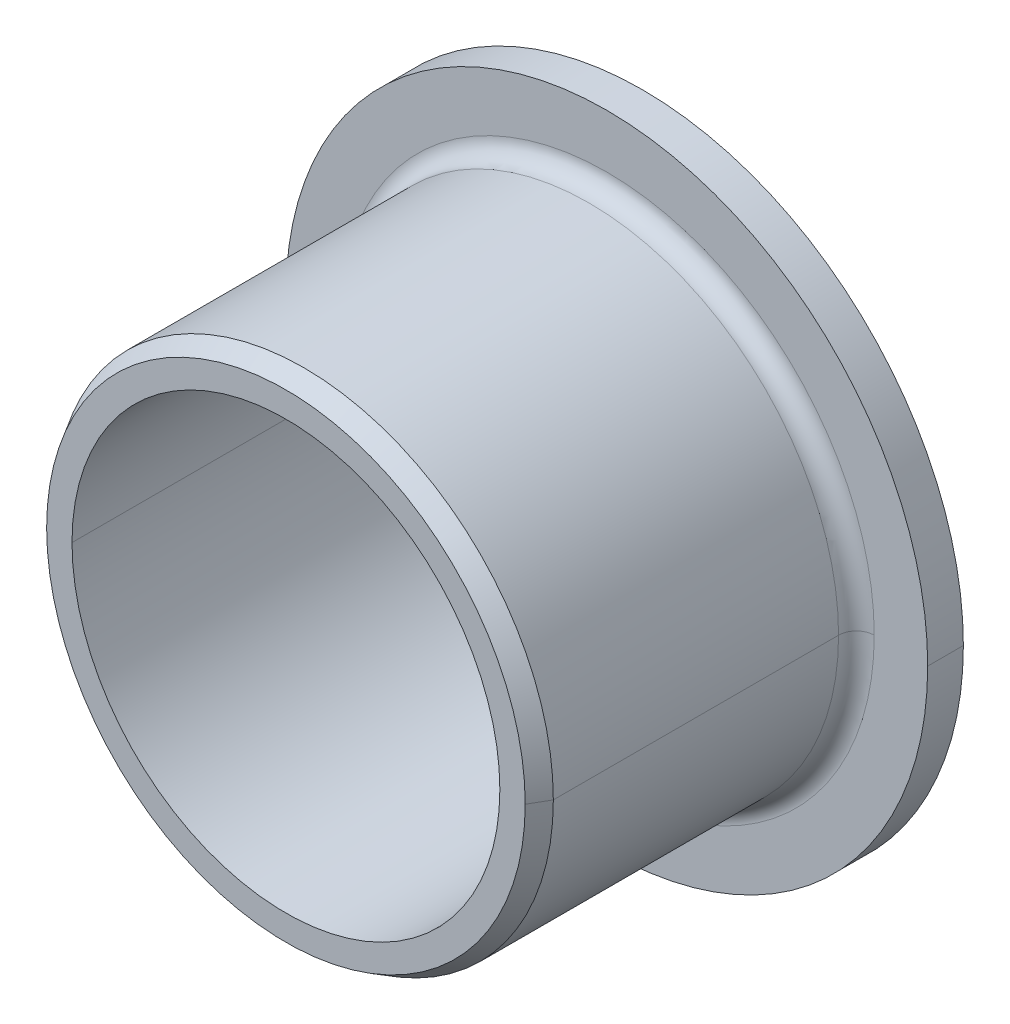
ISO-10303-21;
HEADER;
FILE_DESCRIPTION(('STEP AP214'),'2;1');
FILE_NAME('part.step','',(''),(''),'','','');
FILE_SCHEMA(('AUTOMOTIVE_DESIGN { 1 0 10303 214 1 1 1 1 }'));
ENDSEC;
DATA;
#1=APPLICATION_CONTEXT('core data for automotive mechanical design processes');
#2=APPLICATION_PROTOCOL_DEFINITION('international standard','automotive_design',2000,#1);
#3=PRODUCT_CONTEXT('',#1,'mechanical');
#4=PRODUCT('Part','Part','',(#3));
#5=PRODUCT_RELATED_PRODUCT_CATEGORY('part','',(#4));
#6=PRODUCT_DEFINITION_FORMATION('','',#4);
#7=PRODUCT_DEFINITION_CONTEXT('part definition',#1,'design');
#8=PRODUCT_DEFINITION('design','',#6,#7);
#9=PRODUCT_DEFINITION_SHAPE('','',#8);
#10=(LENGTH_UNIT() NAMED_UNIT(*) SI_UNIT(.MILLI.,.METRE.));
#11=(NAMED_UNIT(*) PLANE_ANGLE_UNIT() SI_UNIT($,.RADIAN.));
#12=(NAMED_UNIT(*) SI_UNIT($,.STERADIAN.) SOLID_ANGLE_UNIT());
#13=UNCERTAINTY_MEASURE_WITH_UNIT(LENGTH_MEASURE(1.E-05),#10,'distance_accuracy_value','');
#14=(GEOMETRIC_REPRESENTATION_CONTEXT(3) GLOBAL_UNCERTAINTY_ASSIGNED_CONTEXT((#13)) GLOBAL_UNIT_ASSIGNED_CONTEXT((#10,
#11,#12)) REPRESENTATION_CONTEXT('',''));
#15=CARTESIAN_POINT('',(0.,0.,0.));
#16=DIRECTION('',(0.,0.,1.));
#17=DIRECTION('',(1.,0.,0.));
#18=AXIS2_PLACEMENT_3D('',#15,#16,#17);
#19=CARTESIAN_POINT('',(7.5,0.,0.));
#20=DIRECTION('',(0.,0.,-1.));
#21=DIRECTION('',(0.,-1.,0.));
#22=AXIS2_PLACEMENT_3D('',#19,#20,#21);
#23=PLANE('',#22);
#24=CARTESIAN_POINT('',(0.,0.,0.));
#25=DIRECTION('',(0.,0.,1.));
#26=DIRECTION('',(1.,0.,0.));
#27=AXIS2_PLACEMENT_3D('',#24,#25,#26);
#28=CIRCLE('',#27,6.);
#29=CARTESIAN_POINT('',(6.,0.,0.));
#30=VERTEX_POINT('',#29);
#31=CARTESIAN_POINT('',(-6.,0.,0.));
#32=VERTEX_POINT('',#31);
#33=EDGE_CURVE('E10',#30,#32,#28,.T.);
#34=ORIENTED_EDGE('',*,*,#33,.T.);
#35=CARTESIAN_POINT('',(0.,0.,0.));
#36=DIRECTION('',(0.,0.,1.));
#37=DIRECTION('',(1.,0.,0.));
#38=AXIS2_PLACEMENT_3D('',#35,#36,#37);
#39=CIRCLE('',#38,6.);
#40=EDGE_CURVE('E325',#32,#30,#39,.T.);
#41=ORIENTED_EDGE('',*,*,#40,.T.);
#42=EDGE_LOOP('',(#34,#41));
#43=FACE_BOUND('',#42,.T.);
#44=CARTESIAN_POINT('',(0.,0.,0.));
#45=DIRECTION('',(0.,0.,1.));
#46=DIRECTION('',(1.,0.,0.));
#47=AXIS2_PLACEMENT_3D('',#44,#45,#46);
#48=CIRCLE('',#47,9.);
#49=CARTESIAN_POINT('',(9.,0.,0.));
#50=VERTEX_POINT('',#49);
#51=CARTESIAN_POINT('',(-9.,0.,0.));
#52=VERTEX_POINT('',#51);
#53=EDGE_CURVE('E398',#50,#52,#48,.T.);
#54=ORIENTED_EDGE('',*,*,#53,.F.);
#55=CARTESIAN_POINT('',(0.,0.,0.));
#56=DIRECTION('',(0.,0.,1.));
#57=DIRECTION('',(1.,0.,0.));
#58=AXIS2_PLACEMENT_3D('',#55,#56,#57);
#59=CIRCLE('',#58,9.);
#60=EDGE_CURVE('E100',#52,#50,#59,.T.);
#61=ORIENTED_EDGE('',*,*,#60,.F.);
#62=EDGE_LOOP('',(#54,#61));
#63=FACE_BOUND('',#62,.T.);
#64=ADVANCED_FACE('F15',(#43,#63),#23,.T.);
#65=CARTESIAN_POINT('',(0.,0.,5.));
#66=DIRECTION('',(0.,0.,1.));
#67=DIRECTION('',(1.,0.,0.));
#68=AXIS2_PLACEMENT_3D('',#65,#66,#67);
#69=CYLINDRICAL_SURFACE('',#68,6.);
#70=DIRECTION('',(0.,0.,1.));
#71=VECTOR('',#70,1.);
#72=CARTESIAN_POINT('',(6.,0.,5.));
#73=LINE('',#72,#71);
#74=CARTESIAN_POINT('',(6.,0.,10.));
#75=VERTEX_POINT('',#74);
#76=EDGE_CURVE('E329',#30,#75,#73,.T.);
#77=ORIENTED_EDGE('',*,*,#76,.T.);
#78=CARTESIAN_POINT('',(0.,0.,10.));
#79=DIRECTION('',(0.,0.,1.));
#80=DIRECTION('',(1.,0.,0.));
#81=AXIS2_PLACEMENT_3D('',#78,#79,#80);
#82=CIRCLE('',#81,6.);
#83=CARTESIAN_POINT('',(-6.,0.,10.));
#84=VERTEX_POINT('',#83);
#85=EDGE_CURVE('E26',#75,#84,#82,.T.);
#86=ORIENTED_EDGE('',*,*,#85,.T.);
#87=DIRECTION('',(0.,0.,-1.));
#88=VECTOR('',#87,1.);
#89=CARTESIAN_POINT('',(-6.,0.,5.));
#90=LINE('',#89,#88);
#91=EDGE_CURVE('E322',#84,#32,#90,.T.);
#92=ORIENTED_EDGE('',*,*,#91,.T.);
#93=ORIENTED_EDGE('',*,*,#33,.F.);
#94=EDGE_LOOP('',(#77,#86,#92,#93));
#95=FACE_BOUND('',#94,.T.);
#96=ADVANCED_FACE('F195',(#95),#69,.F.);
#97=CARTESIAN_POINT('',(6.3556624327,0.,10.));
#98=DIRECTION('',(0.,0.,1.));
#99=DIRECTION('',(1.,0.,0.));
#100=AXIS2_PLACEMENT_3D('',#97,#98,#99);
#101=PLANE('',#100);
#102=ORIENTED_EDGE('',*,*,#85,.F.);
#103=CARTESIAN_POINT('',(0.,0.,10.));
#104=DIRECTION('',(0.,0.,1.));
#105=DIRECTION('',(1.,0.,0.));
#106=AXIS2_PLACEMENT_3D('',#103,#104,#105);
#107=CIRCLE('',#106,6.);
#108=EDGE_CURVE('E315',#84,#75,#107,.T.);
#109=ORIENTED_EDGE('',*,*,#108,.F.);
#110=EDGE_LOOP('',(#102,#109));
#111=FACE_BOUND('',#110,.T.);
#112=CARTESIAN_POINT('',(0.,0.,10.));
#113=DIRECTION('',(0.,0.,1.));
#114=DIRECTION('',(1.,0.,0.));
#115=AXIS2_PLACEMENT_3D('',#112,#113,#114);
#116=CIRCLE('',#115,6.7113248654);
#117=CARTESIAN_POINT('',(6.7113248654,0.,10.));
#118=VERTEX_POINT('',#117);
#119=CARTESIAN_POINT('',(-6.7113248654,0.,10.));
#120=VERTEX_POINT('',#119);
#121=EDGE_CURVE('E19',#118,#120,#116,.T.);
#122=ORIENTED_EDGE('',*,*,#121,.T.);
#123=CARTESIAN_POINT('',(0.,0.,10.));
#124=DIRECTION('',(0.,0.,1.));
#125=DIRECTION('',(1.,0.,0.));
#126=AXIS2_PLACEMENT_3D('',#123,#124,#125);
#127=CIRCLE('',#126,6.7113248654);
#128=EDGE_CURVE('E82',#120,#118,#127,.T.);
#129=ORIENTED_EDGE('',*,*,#128,.T.);
#130=EDGE_LOOP('',(#122,#129));
#131=FACE_BOUND('',#130,.T.);
#132=ADVANCED_FACE('F200',(#111,#131),#101,.T.);
#133=CARTESIAN_POINT('',(0.,0.,9.75));
#134=DIRECTION('',(0.,0.,-1.));
#135=DIRECTION('',(1.,0.,0.));
#136=AXIS2_PLACEMENT_3D('',#133,#134,#135);
#137=CONICAL_SURFACE('',#136,6.8556624327,0.52359877560608);
#138=DIRECTION('',(-0.500000000006738,0.,0.866025403780548));
#139=VECTOR('',#138,1.);
#140=CARTESIAN_POINT('',(6.8556624327,0.,9.75));
#141=LINE('',#140,#139);
#142=CARTESIAN_POINT('',(7.,0.,9.5));
#143=VERTEX_POINT('',#142);
#144=EDGE_CURVE('E310',#143,#118,#141,.T.);
#145=ORIENTED_EDGE('',*,*,#144,.T.);
#146=ORIENTED_EDGE('',*,*,#128,.F.);
#147=DIRECTION('',(-0.500000000006738,0.,-0.866025403780548));
#148=VECTOR('',#147,1.);
#149=CARTESIAN_POINT('',(-6.8556624327,0.,9.75));
#150=LINE('',#149,#148);
#151=CARTESIAN_POINT('',(-7.,0.,9.5));
#152=VERTEX_POINT('',#151);
#153=EDGE_CURVE('E157',#120,#152,#150,.T.);
#154=ORIENTED_EDGE('',*,*,#153,.T.);
#155=CARTESIAN_POINT('',(0.,0.,9.5));
#156=DIRECTION('',(0.,0.,1.));
#157=DIRECTION('',(1.,0.,0.));
#158=AXIS2_PLACEMENT_3D('',#155,#156,#157);
#159=CIRCLE('',#158,7.);
#160=EDGE_CURVE('E72',#152,#143,#159,.T.);
#161=ORIENTED_EDGE('',*,*,#160,.T.);
#162=EDGE_LOOP('',(#145,#146,#154,#161));
#163=FACE_BOUND('',#162,.T.);
#164=ADVANCED_FACE('F17',(#163),#137,.T.);
#165=CARTESIAN_POINT('',(0.,0.,5.5));
#166=DIRECTION('',(0.,0.,1.));
#167=DIRECTION('',(1.,0.,0.));
#168=AXIS2_PLACEMENT_3D('',#165,#166,#167);
#169=CYLINDRICAL_SURFACE('',#168,7.);
#170=DIRECTION('',(0.,0.,1.));
#171=VECTOR('',#170,1.);
#172=CARTESIAN_POINT('',(7.,0.,5.5));
#173=LINE('',#172,#171);
#174=CARTESIAN_POINT('',(7.,0.,1.5));
#175=VERTEX_POINT('',#174);
#176=EDGE_CURVE('E156',#175,#143,#173,.T.);
#177=ORIENTED_EDGE('',*,*,#176,.T.);
#178=ORIENTED_EDGE('',*,*,#160,.F.);
#179=DIRECTION('',(0.,0.,-1.));
#180=VECTOR('',#179,1.);
#181=CARTESIAN_POINT('',(-7.,0.,5.5));
#182=LINE('',#181,#180);
#183=CARTESIAN_POINT('',(-7.,0.,1.5));
#184=VERTEX_POINT('',#183);
#185=EDGE_CURVE('E135',#152,#184,#182,.T.);
#186=ORIENTED_EDGE('',*,*,#185,.T.);
#187=CARTESIAN_POINT('',(0.,0.,1.5));
#188=DIRECTION('',(0.,0.,1.));
#189=DIRECTION('',(1.,0.,0.));
#190=AXIS2_PLACEMENT_3D('',#187,#188,#189);
#191=CIRCLE('',#190,7.);
#192=EDGE_CURVE('E133',#184,#175,#191,.T.);
#193=ORIENTED_EDGE('',*,*,#192,.T.);
#194=EDGE_LOOP('',(#177,#178,#186,#193));
#195=FACE_BOUND('',#194,.T.);
#196=ADVANCED_FACE('F176',(#195),#169,.T.);
#197=CARTESIAN_POINT('',(0.,0.,1.5));
#198=DIRECTION('',(0.,0.,1.));
#199=DIRECTION('',(1.,0.,0.));
#200=AXIS2_PLACEMENT_3D('',#197,#198,#199);
#201=TOROIDAL_SURFACE('',#200,7.5,0.5);
#202=CARTESIAN_POINT('',(-7.5,0.,1.5));
#203=DIRECTION('',(0.,-1.,0.));
#204=DIRECTION('',(-1.,0.,0.));
#205=AXIS2_PLACEMENT_3D('',#202,#203,#204);
#206=CIRCLE('',#205,0.5);
#207=CARTESIAN_POINT('',(-7.5,0.,1.));
#208=VERTEX_POINT('',#207);
#209=EDGE_CURVE('E119',#208,#184,#206,.T.);
#210=ORIENTED_EDGE('',*,*,#209,.T.);
#211=CARTESIAN_POINT('',(0.,0.,1.5));
#212=DIRECTION('',(0.,0.,1.));
#213=DIRECTION('',(1.,0.,0.));
#214=AXIS2_PLACEMENT_3D('',#211,#212,#213);
#215=CIRCLE('',#214,7.);
#216=EDGE_CURVE('E141',#175,#184,#215,.T.);
#217=ORIENTED_EDGE('',*,*,#216,.F.);
#218=CARTESIAN_POINT('',(7.5,0.,1.5));
#219=DIRECTION('',(0.,-1.,0.));
#220=DIRECTION('',(1.,0.,0.));
#221=AXIS2_PLACEMENT_3D('',#218,#219,#220);
#222=CIRCLE('',#221,0.5);
#223=CARTESIAN_POINT('',(7.5,0.,1.));
#224=VERTEX_POINT('',#223);
#225=EDGE_CURVE('E121',#175,#224,#222,.T.);
#226=ORIENTED_EDGE('',*,*,#225,.T.);
#227=CARTESIAN_POINT('',(0.,0.,1.));
#228=DIRECTION('',(0.,0.,1.));
#229=DIRECTION('',(1.,0.,0.));
#230=AXIS2_PLACEMENT_3D('',#227,#228,#229);
#231=CIRCLE('',#230,7.5);
#232=EDGE_CURVE('E110',#224,#208,#231,.T.);
#233=ORIENTED_EDGE('',*,*,#232,.T.);
#234=EDGE_LOOP('',(#210,#217,#226,#233));
#235=FACE_BOUND('',#234,.T.);
#236=ADVANCED_FACE('F116',(#235),#201,.F.);
#237=CARTESIAN_POINT('',(8.25,0.,1.));
#238=DIRECTION('',(0.,0.,1.));
#239=DIRECTION('',(1.,0.,0.));
#240=AXIS2_PLACEMENT_3D('',#237,#238,#239);
#241=PLANE('',#240);
#242=ORIENTED_EDGE('',*,*,#232,.F.);
#243=CARTESIAN_POINT('',(0.,0.,1.));
#244=DIRECTION('',(0.,0.,1.));
#245=DIRECTION('',(1.,0.,0.));
#246=AXIS2_PLACEMENT_3D('',#243,#244,#245);
#247=CIRCLE('',#246,7.5);
#248=EDGE_CURVE('E125',#208,#224,#247,.T.);
#249=ORIENTED_EDGE('',*,*,#248,.F.);
#250=EDGE_LOOP('',(#242,#249));
#251=FACE_BOUND('',#250,.T.);
#252=CARTESIAN_POINT('',(0.,0.,1.));
#253=DIRECTION('',(0.,0.,1.));
#254=DIRECTION('',(1.,0.,0.));
#255=AXIS2_PLACEMENT_3D('',#252,#253,#254);
#256=CIRCLE('',#255,9.);
#257=CARTESIAN_POINT('',(9.,0.,1.));
#258=VERTEX_POINT('',#257);
#259=CARTESIAN_POINT('',(-9.,0.,1.));
#260=VERTEX_POINT('',#259);
#261=EDGE_CURVE('E147',#258,#260,#256,.T.);
#262=ORIENTED_EDGE('',*,*,#261,.T.);
#263=CARTESIAN_POINT('',(0.,0.,1.));
#264=DIRECTION('',(0.,0.,1.));
#265=DIRECTION('',(1.,0.,0.));
#266=AXIS2_PLACEMENT_3D('',#263,#264,#265);
#267=CIRCLE('',#266,9.);
#268=EDGE_CURVE('E40',#260,#258,#267,.T.);
#269=ORIENTED_EDGE('',*,*,#268,.T.);
#270=EDGE_LOOP('',(#262,#269));
#271=FACE_BOUND('',#270,.T.);
#272=ADVANCED_FACE('F126',(#251,#271),#241,.T.);
#273=CARTESIAN_POINT('',(0.,0.,0.5));
#274=DIRECTION('',(0.,0.,1.));
#275=DIRECTION('',(1.,0.,0.));
#276=AXIS2_PLACEMENT_3D('',#273,#274,#275);
#277=CYLINDRICAL_SURFACE('',#276,9.);
#278=DIRECTION('',(0.,0.,1.));
#279=VECTOR('',#278,1.);
#280=CARTESIAN_POINT('',(9.,0.,0.5));
#281=LINE('',#280,#279);
#282=EDGE_CURVE('E392',#50,#258,#281,.T.);
#283=ORIENTED_EDGE('',*,*,#282,.T.);
#284=ORIENTED_EDGE('',*,*,#268,.F.);
#285=DIRECTION('',(0.,0.,-1.));
#286=VECTOR('',#285,1.);
#287=CARTESIAN_POINT('',(-9.,0.,0.5));
#288=LINE('',#287,#286);
#289=EDGE_CURVE('E145',#260,#52,#288,.T.);
#290=ORIENTED_EDGE('',*,*,#289,.T.);
#291=ORIENTED_EDGE('',*,*,#60,.T.);
#292=EDGE_LOOP('',(#283,#284,#290,#291));
#293=FACE_BOUND('',#292,.T.);
#294=ADVANCED_FACE('F188',(#293),#277,.T.);
#295=CARTESIAN_POINT('',(0.,0.,0.5));
#296=DIRECTION('',(0.,0.,1.));
#297=DIRECTION('',(1.,0.,0.));
#298=AXIS2_PLACEMENT_3D('',#295,#296,#297);
#299=CYLINDRICAL_SURFACE('',#298,9.);
#300=ORIENTED_EDGE('',*,*,#282,.F.);
#301=ORIENTED_EDGE('',*,*,#53,.T.);
#302=ORIENTED_EDGE('',*,*,#289,.F.);
#303=ORIENTED_EDGE('',*,*,#261,.F.);
#304=EDGE_LOOP('',(#300,#301,#302,#303));
#305=FACE_BOUND('',#304,.T.);
#306=ADVANCED_FACE('F183',(#305),#299,.T.);
#307=CARTESIAN_POINT('',(0.,0.,1.5));
#308=DIRECTION('',(0.,0.,1.));
#309=DIRECTION('',(1.,0.,0.));
#310=AXIS2_PLACEMENT_3D('',#307,#308,#309);
#311=TOROIDAL_SURFACE('',#310,7.5,0.5);
#312=ORIENTED_EDGE('',*,*,#209,.F.);
#313=ORIENTED_EDGE('',*,*,#248,.T.);
#314=ORIENTED_EDGE('',*,*,#225,.F.);
#315=ORIENTED_EDGE('',*,*,#192,.F.);
#316=EDGE_LOOP('',(#312,#313,#314,#315));
#317=FACE_BOUND('',#316,.T.);
#318=ADVANCED_FACE('F131',(#317),#311,.F.);
#319=CARTESIAN_POINT('',(0.,0.,5.5));
#320=DIRECTION('',(0.,0.,1.));
#321=DIRECTION('',(1.,0.,0.));
#322=AXIS2_PLACEMENT_3D('',#319,#320,#321);
#323=CYLINDRICAL_SURFACE('',#322,7.);
#324=ORIENTED_EDGE('',*,*,#176,.F.);
#325=ORIENTED_EDGE('',*,*,#216,.T.);
#326=ORIENTED_EDGE('',*,*,#185,.F.);
#327=CARTESIAN_POINT('',(0.,0.,9.5));
#328=DIRECTION('',(0.,0.,1.));
#329=DIRECTION('',(1.,0.,0.));
#330=AXIS2_PLACEMENT_3D('',#327,#328,#329);
#331=CIRCLE('',#330,7.);
#332=EDGE_CURVE('E314',#143,#152,#331,.T.);
#333=ORIENTED_EDGE('',*,*,#332,.F.);
#334=EDGE_LOOP('',(#324,#325,#326,#333));
#335=FACE_BOUND('',#334,.T.);
#336=ADVANCED_FACE('F158',(#335),#323,.T.);
#337=CARTESIAN_POINT('',(0.,0.,9.75));
#338=DIRECTION('',(0.,0.,-1.));
#339=DIRECTION('',(1.,0.,0.));
#340=AXIS2_PLACEMENT_3D('',#337,#338,#339);
#341=CONICAL_SURFACE('',#340,6.8556624327,0.52359877560608);
#342=ORIENTED_EDGE('',*,*,#144,.F.);
#343=ORIENTED_EDGE('',*,*,#332,.T.);
#344=ORIENTED_EDGE('',*,*,#153,.F.);
#345=ORIENTED_EDGE('',*,*,#121,.F.);
#346=EDGE_LOOP('',(#342,#343,#344,#345));
#347=FACE_BOUND('',#346,.T.);
#348=ADVANCED_FACE('F163',(#347),#341,.T.);
#349=CARTESIAN_POINT('',(0.,0.,5.));
#350=DIRECTION('',(0.,0.,1.));
#351=DIRECTION('',(1.,0.,0.));
#352=AXIS2_PLACEMENT_3D('',#349,#350,#351);
#353=CYLINDRICAL_SURFACE('',#352,6.);
#354=ORIENTED_EDGE('',*,*,#76,.F.);
#355=ORIENTED_EDGE('',*,*,#40,.F.);
#356=ORIENTED_EDGE('',*,*,#91,.F.);
#357=ORIENTED_EDGE('',*,*,#108,.T.);
#358=EDGE_LOOP('',(#354,#355,#356,#357));
#359=FACE_BOUND('',#358,.T.);
#360=ADVANCED_FACE('F249',(#359),#353,.F.);
#361=CLOSED_SHELL('',(#64,#96,#132,#164,#196,#236,#272,#294,#306,#318,#336,#348,#360));
#362=MANIFOLD_SOLID_BREP('B1',#361);
#363=ADVANCED_BREP_SHAPE_REPRESENTATION('',(#18,#362),#14);
#364=SHAPE_DEFINITION_REPRESENTATION(#9,#363);
ENDSEC;
END-ISO-10303-21;
